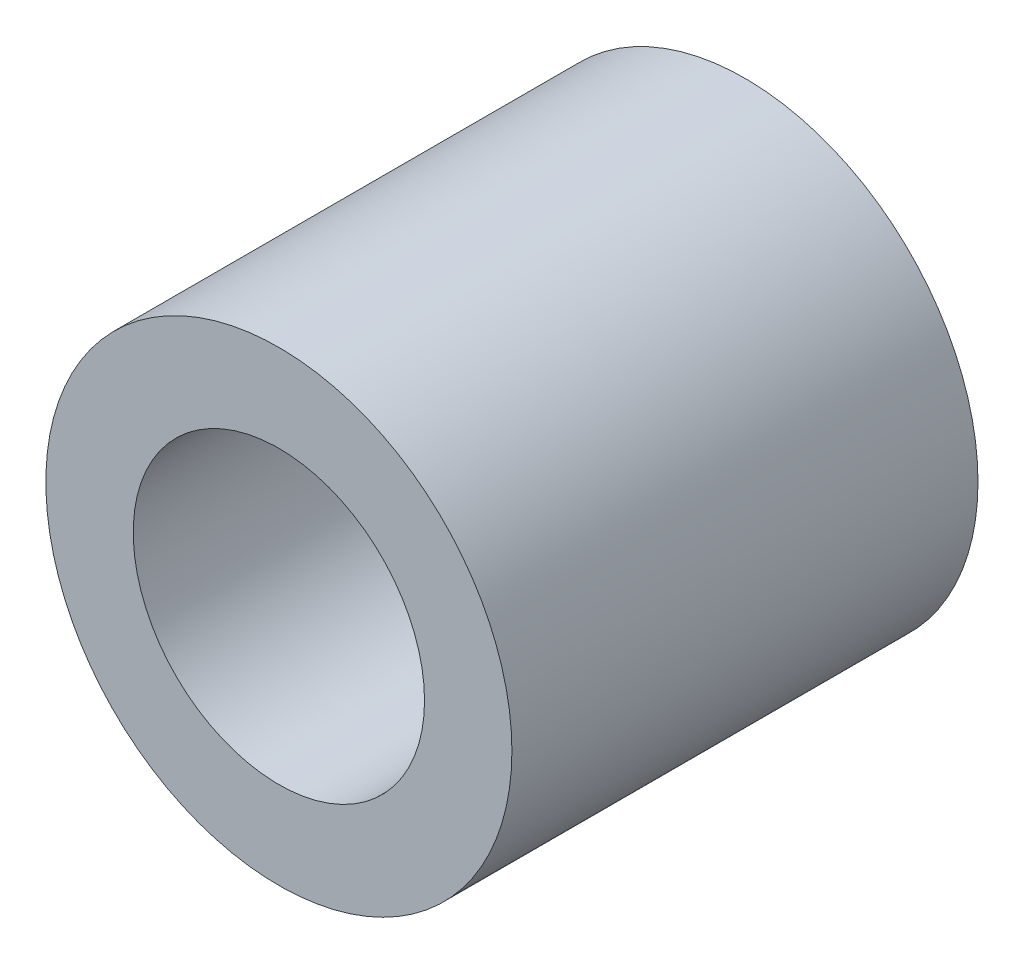
ISO-10303-21;
HEADER;
FILE_DESCRIPTION(('STEP AP214'),'2;1');
FILE_NAME('part.step','',(''),(''),'','','');
FILE_SCHEMA(('AUTOMOTIVE_DESIGN { 1 0 10303 214 1 1 1 1 }'));
ENDSEC;
DATA;
#1=APPLICATION_CONTEXT('core data for automotive mechanical design processes');
#2=APPLICATION_PROTOCOL_DEFINITION('international standard','automotive_design',2000,#1);
#3=PRODUCT_CONTEXT('',#1,'mechanical');
#4=PRODUCT('Part','Part','',(#3));
#5=PRODUCT_RELATED_PRODUCT_CATEGORY('part','',(#4));
#6=PRODUCT_DEFINITION_FORMATION('','',#4);
#7=PRODUCT_DEFINITION_CONTEXT('part definition',#1,'design');
#8=PRODUCT_DEFINITION('design','',#6,#7);
#9=PRODUCT_DEFINITION_SHAPE('','',#8);
#10=(LENGTH_UNIT() NAMED_UNIT(*) SI_UNIT(.MILLI.,.METRE.));
#11=(NAMED_UNIT(*) PLANE_ANGLE_UNIT() SI_UNIT($,.RADIAN.));
#12=(NAMED_UNIT(*) SI_UNIT($,.STERADIAN.) SOLID_ANGLE_UNIT());
#13=UNCERTAINTY_MEASURE_WITH_UNIT(LENGTH_MEASURE(1.E-05),#10,'distance_accuracy_value','');
#14=(GEOMETRIC_REPRESENTATION_CONTEXT(3) GLOBAL_UNCERTAINTY_ASSIGNED_CONTEXT((#13)) GLOBAL_UNIT_ASSIGNED_CONTEXT((#10,
#11,#12)) REPRESENTATION_CONTEXT('',''));
#15=CARTESIAN_POINT('',(0.,0.,0.));
#16=DIRECTION('',(0.,0.,1.));
#17=DIRECTION('',(1.,0.,0.));
#18=AXIS2_PLACEMENT_3D('',#15,#16,#17);
#19=CARTESIAN_POINT('',(0.,0.,16.));
#20=DIRECTION('',(0.,0.,1.));
#21=DIRECTION('',(1.,0.,0.));
#22=AXIS2_PLACEMENT_3D('',#19,#20,#21);
#23=PLANE('',#22);
#24=CARTESIAN_POINT('',(0.,0.,16.));
#25=DIRECTION('',(0.,0.,1.));
#26=DIRECTION('',(1.,0.,0.));
#27=AXIS2_PLACEMENT_3D('',#24,#25,#26);
#28=CIRCLE('',#27,8.);
#29=CARTESIAN_POINT('',(8.,0.,16.));
#30=VERTEX_POINT('',#29);
#31=EDGE_CURVE('E10',#30,#30,#28,.T.);
#32=ORIENTED_EDGE('',*,*,#31,.T.);
#33=EDGE_LOOP('',(#32));
#34=FACE_BOUND('',#33,.T.);
#35=CARTESIAN_POINT('',(0.,0.,16.));
#36=DIRECTION('',(0.,0.,1.));
#37=DIRECTION('',(1.,0.,0.));
#38=AXIS2_PLACEMENT_3D('',#35,#36,#37);
#39=CIRCLE('',#38,5.);
#40=CARTESIAN_POINT('',(5.,0.,16.));
#41=VERTEX_POINT('',#40);
#42=EDGE_CURVE('E42',#41,#41,#39,.T.);
#43=ORIENTED_EDGE('',*,*,#42,.F.);
#44=EDGE_LOOP('',(#43));
#45=FACE_BOUND('',#44,.T.);
#46=ADVANCED_FACE('F31',(#34,#45),#23,.T.);
#47=CARTESIAN_POINT('',(0.,0.,0.));
#48=DIRECTION('',(0.,0.,1.));
#49=DIRECTION('',(1.,0.,0.));
#50=AXIS2_PLACEMENT_3D('',#47,#48,#49);
#51=PLANE('',#50);
#52=CARTESIAN_POINT('',(0.,0.,0.));
#53=DIRECTION('',(0.,0.,1.));
#54=DIRECTION('',(1.,0.,0.));
#55=AXIS2_PLACEMENT_3D('',#52,#53,#54);
#56=CIRCLE('',#55,8.);
#57=CARTESIAN_POINT('',(8.,0.,0.));
#58=VERTEX_POINT('',#57);
#59=EDGE_CURVE('E35',#58,#58,#56,.T.);
#60=ORIENTED_EDGE('',*,*,#59,.F.);
#61=EDGE_LOOP('',(#60));
#62=FACE_BOUND('',#61,.T.);
#63=CARTESIAN_POINT('',(0.,0.,0.));
#64=DIRECTION('',(0.,0.,1.));
#65=DIRECTION('',(1.,0.,0.));
#66=AXIS2_PLACEMENT_3D('',#63,#64,#65);
#67=CIRCLE('',#66,5.);
#68=CARTESIAN_POINT('',(5.,0.,0.));
#69=VERTEX_POINT('',#68);
#70=EDGE_CURVE('E44',#69,#69,#67,.T.);
#71=ORIENTED_EDGE('',*,*,#70,.T.);
#72=EDGE_LOOP('',(#71));
#73=FACE_BOUND('',#72,.T.);
#74=ADVANCED_FACE('F54',(#62,#73),#51,.F.);
#75=CARTESIAN_POINT('',(0.,0.,16.));
#76=DIRECTION('',(0.,0.,-1.));
#77=DIRECTION('',(-1.,0.,0.));
#78=AXIS2_PLACEMENT_3D('',#75,#76,#77);
#79=CYLINDRICAL_SURFACE('',#78,8.);
#80=ORIENTED_EDGE('',*,*,#31,.F.);
#81=EDGE_LOOP('',(#80));
#82=FACE_BOUND('',#81,.T.);
#83=ORIENTED_EDGE('',*,*,#59,.T.);
#84=EDGE_LOOP('',(#83));
#85=FACE_BOUND('',#84,.T.);
#86=ADVANCED_FACE('F33',(#82,#85),#79,.T.);
#87=CARTESIAN_POINT('',(0.,0.,16.));
#88=DIRECTION('',(0.,0.,-1.));
#89=DIRECTION('',(-1.,0.,0.));
#90=AXIS2_PLACEMENT_3D('',#87,#88,#89);
#91=CYLINDRICAL_SURFACE('',#90,5.);
#92=ORIENTED_EDGE('',*,*,#42,.T.);
#93=EDGE_LOOP('',(#92));
#94=FACE_BOUND('',#93,.T.);
#95=ORIENTED_EDGE('',*,*,#70,.F.);
#96=EDGE_LOOP('',(#95));
#97=FACE_BOUND('',#96,.T.);
#98=ADVANCED_FACE('F50',(#94,#97),#91,.F.);
#99=CLOSED_SHELL('',(#46,#74,#86,#98));
#100=MANIFOLD_SOLID_BREP('B2',#99);
#101=ADVANCED_BREP_SHAPE_REPRESENTATION('',(#18,#100),#14);
#102=SHAPE_DEFINITION_REPRESENTATION(#9,#101);
ENDSEC;
END-ISO-10303-21;
